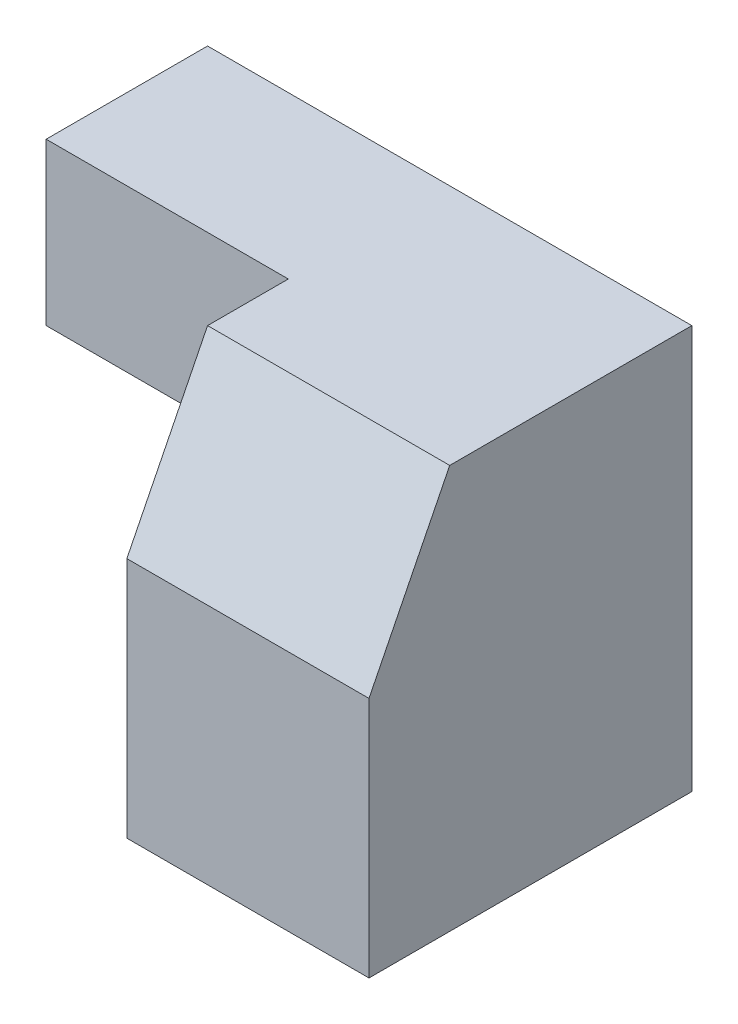
ISO-10303-21;
HEADER;
FILE_DESCRIPTION(('STEP AP214'),'2;1');
FILE_NAME('part.step','',(''),(''),'','','');
FILE_SCHEMA(('AUTOMOTIVE_DESIGN { 1 0 10303 214 1 1 1 1 }'));
ENDSEC;
DATA;
#1=APPLICATION_CONTEXT('core data for automotive mechanical design processes');
#2=APPLICATION_PROTOCOL_DEFINITION('international standard','automotive_design',2000,#1);
#3=PRODUCT_CONTEXT('',#1,'mechanical');
#4=PRODUCT('Part','Part','',(#3));
#5=PRODUCT_RELATED_PRODUCT_CATEGORY('part','',(#4));
#6=PRODUCT_DEFINITION_FORMATION('','',#4);
#7=PRODUCT_DEFINITION_CONTEXT('part definition',#1,'design');
#8=PRODUCT_DEFINITION('design','',#6,#7);
#9=PRODUCT_DEFINITION_SHAPE('','',#8);
#10=(LENGTH_UNIT() NAMED_UNIT(*) SI_UNIT(.MILLI.,.METRE.));
#11=(NAMED_UNIT(*) PLANE_ANGLE_UNIT() SI_UNIT($,.RADIAN.));
#12=(NAMED_UNIT(*) SI_UNIT($,.STERADIAN.) SOLID_ANGLE_UNIT());
#13=UNCERTAINTY_MEASURE_WITH_UNIT(LENGTH_MEASURE(1.E-05),#10,'distance_accuracy_value','');
#14=(GEOMETRIC_REPRESENTATION_CONTEXT(3) GLOBAL_UNCERTAINTY_ASSIGNED_CONTEXT((#13)) GLOBAL_UNIT_ASSIGNED_CONTEXT((#10,
#11,#12)) REPRESENTATION_CONTEXT('',''));
#15=CARTESIAN_POINT('',(0.,0.,0.));
#16=DIRECTION('',(0.,0.,1.));
#17=DIRECTION('',(1.,0.,0.));
#18=AXIS2_PLACEMENT_3D('',#15,#16,#17);
#19=CARTESIAN_POINT('',(0.,0.,20.));
#20=DIRECTION('',(1.,0.,0.));
#21=DIRECTION('',(0.,0.,-1.));
#22=AXIS2_PLACEMENT_3D('',#19,#20,#21);
#23=PLANE('',#22);
#24=DIRECTION('',(0.,-1.,0.));
#25=VECTOR('',#24,1.);
#26=CARTESIAN_POINT('',(0.,0.,0.));
#27=LINE('',#26,#25);
#28=CARTESIAN_POINT('',(0.,25.,0.));
#29=VERTEX_POINT('',#28);
#30=CARTESIAN_POINT('',(0.,15.,0.));
#31=VERTEX_POINT('',#30);
#32=EDGE_CURVE('E120',#29,#31,#27,.T.);
#33=ORIENTED_EDGE('',*,*,#32,.T.);
#34=DIRECTION('',(0.,0.,-1.));
#35=VECTOR('',#34,1.);
#36=CARTESIAN_POINT('',(0.,15.,0.));
#37=LINE('',#36,#35);
#38=CARTESIAN_POINT('',(0.,15.,10.));
#39=VERTEX_POINT('',#38);
#40=EDGE_CURVE('E113',#39,#31,#37,.T.);
#41=ORIENTED_EDGE('',*,*,#40,.F.);
#42=DIRECTION('',(0.,-1.,0.));
#43=VECTOR('',#42,1.);
#44=CARTESIAN_POINT('',(0.,0.,10.));
#45=LINE('',#44,#43);
#46=CARTESIAN_POINT('',(0.,25.,10.));
#47=VERTEX_POINT('',#46);
#48=EDGE_CURVE('E147',#47,#39,#45,.T.);
#49=ORIENTED_EDGE('',*,*,#48,.F.);
#50=DIRECTION('',(0.,0.,-1.));
#51=VECTOR('',#50,1.);
#52=CARTESIAN_POINT('',(0.,25.,20.));
#53=LINE('',#52,#51);
#54=EDGE_CURVE('E130',#47,#29,#53,.T.);
#55=ORIENTED_EDGE('',*,*,#54,.T.);
#56=EDGE_LOOP('',(#33,#41,#49,#55));
#57=FACE_BOUND('',#56,.T.);
#58=ADVANCED_FACE('F33',(#57),#23,.F.);
#59=CARTESIAN_POINT('',(0.,0.,20.));
#60=DIRECTION('',(0.,1.,0.));
#61=DIRECTION('',(0.,0.,1.));
#62=AXIS2_PLACEMENT_3D('',#59,#60,#61);
#63=PLANE('',#62);
#64=DIRECTION('',(0.,0.,1.));
#65=VECTOR('',#64,1.);
#66=CARTESIAN_POINT('',(15.,0.,10.));
#67=LINE('',#66,#65);
#68=CARTESIAN_POINT('',(15.,0.,0.));
#69=VERTEX_POINT('',#68);
#70=CARTESIAN_POINT('',(15.,0.,20.));
#71=VERTEX_POINT('',#70);
#72=EDGE_CURVE('E55',#69,#71,#67,.T.);
#73=ORIENTED_EDGE('',*,*,#72,.F.);
#74=DIRECTION('',(1.,0.,0.));
#75=VECTOR('',#74,1.);
#76=CARTESIAN_POINT('',(0.,0.,0.));
#77=LINE('',#76,#75);
#78=CARTESIAN_POINT('',(30.,0.,0.));
#79=VERTEX_POINT('',#78);
#80=EDGE_CURVE('E100',#69,#79,#77,.T.);
#81=ORIENTED_EDGE('',*,*,#80,.T.);
#82=DIRECTION('',(0.,0.,-1.));
#83=VECTOR('',#82,1.);
#84=CARTESIAN_POINT('',(30.,0.,20.));
#85=LINE('',#84,#83);
#86=CARTESIAN_POINT('',(30.,0.,20.));
#87=VERTEX_POINT('',#86);
#88=EDGE_CURVE('E11',#87,#79,#85,.T.);
#89=ORIENTED_EDGE('',*,*,#88,.F.);
#90=DIRECTION('',(1.,0.,0.));
#91=VECTOR('',#90,1.);
#92=CARTESIAN_POINT('',(0.,0.,20.));
#93=LINE('',#92,#91);
#94=EDGE_CURVE('E101',#71,#87,#93,.T.);
#95=ORIENTED_EDGE('',*,*,#94,.F.);
#96=EDGE_LOOP('',(#73,#81,#89,#95));
#97=FACE_BOUND('',#96,.T.);
#98=ADVANCED_FACE('F97',(#97),#63,.F.);
#99=CARTESIAN_POINT('',(30.,0.,20.));
#100=DIRECTION('',(-1.,0.,0.));
#101=DIRECTION('',(0.,0.,1.));
#102=AXIS2_PLACEMENT_3D('',#99,#100,#101);
#103=PLANE('',#102);
#104=DIRECTION('',(0.,0.,-1.));
#105=VECTOR('',#104,1.);
#106=CARTESIAN_POINT('',(30.,25.,20.));
#107=LINE('',#106,#105);
#108=CARTESIAN_POINT('',(30.,25.,15.));
#109=VERTEX_POINT('',#108);
#110=CARTESIAN_POINT('',(30.,25.,0.));
#111=VERTEX_POINT('',#110);
#112=EDGE_CURVE('E40',#109,#111,#107,.T.);
#113=ORIENTED_EDGE('',*,*,#112,.F.);
#114=DIRECTION('',(0.,-0.894427190999916,0.447213595499958));
#115=VECTOR('',#114,1.);
#116=CARTESIAN_POINT('',(30.,3.,26.));
#117=LINE('',#116,#115);
#118=CARTESIAN_POINT('',(30.,15.,20.));
#119=VERTEX_POINT('',#118);
#120=EDGE_CURVE('E158',#109,#119,#117,.T.);
#121=ORIENTED_EDGE('',*,*,#120,.T.);
#122=DIRECTION('',(0.,1.,0.));
#123=VECTOR('',#122,1.);
#124=CARTESIAN_POINT('',(30.,0.,20.));
#125=LINE('',#124,#123);
#126=EDGE_CURVE('E131',#87,#119,#125,.T.);
#127=ORIENTED_EDGE('',*,*,#126,.F.);
#128=ORIENTED_EDGE('',*,*,#88,.T.);
#129=DIRECTION('',(0.,1.,0.));
#130=VECTOR('',#129,1.);
#131=CARTESIAN_POINT('',(30.,0.,0.));
#132=LINE('',#131,#130);
#133=EDGE_CURVE('E119',#79,#111,#132,.T.);
#134=ORIENTED_EDGE('',*,*,#133,.T.);
#135=EDGE_LOOP('',(#113,#121,#127,#128,#134));
#136=FACE_BOUND('',#135,.T.);
#137=ADVANCED_FACE('F140',(#136),#103,.F.);
#138=CARTESIAN_POINT('',(0.,25.,20.));
#139=DIRECTION('',(0.,-1.,0.));
#140=DIRECTION('',(0.,0.,-1.));
#141=AXIS2_PLACEMENT_3D('',#138,#139,#140);
#142=PLANE('',#141);
#143=DIRECTION('',(0.,0.,1.));
#144=VECTOR('',#143,1.);
#145=CARTESIAN_POINT('',(15.,25.,10.));
#146=LINE('',#145,#144);
#147=CARTESIAN_POINT('',(15.,25.,10.));
#148=VERTEX_POINT('',#147);
#149=CARTESIAN_POINT('',(15.,25.,15.));
#150=VERTEX_POINT('',#149);
#151=EDGE_CURVE('E102',#148,#150,#146,.T.);
#152=ORIENTED_EDGE('',*,*,#151,.T.);
#153=DIRECTION('',(-1.,0.,0.));
#154=VECTOR('',#153,1.);
#155=CARTESIAN_POINT('',(35.,25.,15.));
#156=LINE('',#155,#154);
#157=EDGE_CURVE('E47',#109,#150,#156,.T.);
#158=ORIENTED_EDGE('',*,*,#157,.F.);
#159=ORIENTED_EDGE('',*,*,#112,.T.);
#160=DIRECTION('',(-1.,0.,0.));
#161=VECTOR('',#160,1.);
#162=CARTESIAN_POINT('',(0.,25.,0.));
#163=LINE('',#162,#161);
#164=EDGE_CURVE('E122',#111,#29,#163,.T.);
#165=ORIENTED_EDGE('',*,*,#164,.T.);
#166=ORIENTED_EDGE('',*,*,#54,.F.);
#167=DIRECTION('',(-1.,0.,0.));
#168=VECTOR('',#167,1.);
#169=CARTESIAN_POINT('',(0.,25.,10.));
#170=LINE('',#169,#168);
#171=EDGE_CURVE('E103',#148,#47,#170,.T.);
#172=ORIENTED_EDGE('',*,*,#171,.F.);
#173=EDGE_LOOP('',(#152,#158,#159,#165,#166,#172));
#174=FACE_BOUND('',#173,.T.);
#175=ADVANCED_FACE('F135',(#174),#142,.F.);
#176=CARTESIAN_POINT('',(0.,0.,20.));
#177=DIRECTION('',(0.,0.,-1.));
#178=DIRECTION('',(-1.,0.,0.));
#179=AXIS2_PLACEMENT_3D('',#176,#177,#178);
#180=PLANE('',#179);
#181=ORIENTED_EDGE('',*,*,#126,.T.);
#182=DIRECTION('',(-1.,0.,0.));
#183=VECTOR('',#182,1.);
#184=CARTESIAN_POINT('',(35.,15.,20.));
#185=LINE('',#184,#183);
#186=CARTESIAN_POINT('',(15.,15.,20.));
#187=VERTEX_POINT('',#186);
#188=EDGE_CURVE('E164',#119,#187,#185,.T.);
#189=ORIENTED_EDGE('',*,*,#188,.T.);
#190=DIRECTION('',(0.,1.,0.));
#191=VECTOR('',#190,1.);
#192=CARTESIAN_POINT('',(15.,0.,20.));
#193=LINE('',#192,#191);
#194=EDGE_CURVE('E156',#71,#187,#193,.T.);
#195=ORIENTED_EDGE('',*,*,#194,.F.);
#196=ORIENTED_EDGE('',*,*,#94,.T.);
#197=EDGE_LOOP('',(#181,#189,#195,#196));
#198=FACE_BOUND('',#197,.T.);
#199=ADVANCED_FACE('F163',(#198),#180,.F.);
#200=CARTESIAN_POINT('',(0.,0.,0.));
#201=DIRECTION('',(0.,0.,-1.));
#202=DIRECTION('',(-1.,0.,0.));
#203=AXIS2_PLACEMENT_3D('',#200,#201,#202);
#204=PLANE('',#203);
#205=DIRECTION('',(-1.,0.,0.));
#206=VECTOR('',#205,1.);
#207=CARTESIAN_POINT('',(15.,15.,0.));
#208=LINE('',#207,#206);
#209=CARTESIAN_POINT('',(15.,15.,0.));
#210=VERTEX_POINT('',#209);
#211=EDGE_CURVE('E142',#210,#31,#208,.T.);
#212=ORIENTED_EDGE('',*,*,#211,.T.);
#213=ORIENTED_EDGE('',*,*,#32,.F.);
#214=ORIENTED_EDGE('',*,*,#164,.F.);
#215=ORIENTED_EDGE('',*,*,#133,.F.);
#216=ORIENTED_EDGE('',*,*,#80,.F.);
#217=DIRECTION('',(0.,-1.,0.));
#218=VECTOR('',#217,1.);
#219=CARTESIAN_POINT('',(15.,0.,0.));
#220=LINE('',#219,#218);
#221=EDGE_CURVE('E107',#210,#69,#220,.T.);
#222=ORIENTED_EDGE('',*,*,#221,.F.);
#223=EDGE_LOOP('',(#212,#213,#214,#215,#216,#222));
#224=FACE_BOUND('',#223,.T.);
#225=ADVANCED_FACE('F116',(#224),#204,.T.);
#226=CARTESIAN_POINT('',(15.,0.,10.));
#227=DIRECTION('',(1.,0.,0.));
#228=DIRECTION('',(0.,0.,-1.));
#229=AXIS2_PLACEMENT_3D('',#226,#227,#228);
#230=PLANE('',#229);
#231=ORIENTED_EDGE('',*,*,#194,.T.);
#232=DIRECTION('',(0.,-0.894427190999916,0.447213595499958));
#233=VECTOR('',#232,1.);
#234=CARTESIAN_POINT('',(15.,25.,15.));
#235=LINE('',#234,#233);
#236=EDGE_CURVE('E173',#150,#187,#235,.T.);
#237=ORIENTED_EDGE('',*,*,#236,.F.);
#238=ORIENTED_EDGE('',*,*,#151,.F.);
#239=DIRECTION('',(0.,1.,0.));
#240=VECTOR('',#239,1.);
#241=CARTESIAN_POINT('',(15.,0.,10.));
#242=LINE('',#241,#240);
#243=CARTESIAN_POINT('',(15.,15.,10.));
#244=VERTEX_POINT('',#243);
#245=EDGE_CURVE('E151',#244,#148,#242,.T.);
#246=ORIENTED_EDGE('',*,*,#245,.F.);
#247=DIRECTION('',(0.,0.,-1.));
#248=VECTOR('',#247,1.);
#249=CARTESIAN_POINT('',(15.,15.,0.));
#250=LINE('',#249,#248);
#251=EDGE_CURVE('E110',#244,#210,#250,.T.);
#252=ORIENTED_EDGE('',*,*,#251,.T.);
#253=ORIENTED_EDGE('',*,*,#221,.T.);
#254=ORIENTED_EDGE('',*,*,#72,.T.);
#255=EDGE_LOOP('',(#231,#237,#238,#246,#252,#253,#254));
#256=FACE_BOUND('',#255,.T.);
#257=ADVANCED_FACE('F108',(#256),#230,.F.);
#258=CARTESIAN_POINT('',(0.,0.,10.));
#259=DIRECTION('',(0.,0.,-1.));
#260=DIRECTION('',(-1.,0.,0.));
#261=AXIS2_PLACEMENT_3D('',#258,#259,#260);
#262=PLANE('',#261);
#263=ORIENTED_EDGE('',*,*,#48,.T.);
#264=DIRECTION('',(-1.,0.,0.));
#265=VECTOR('',#264,1.);
#266=CARTESIAN_POINT('',(15.,15.,10.));
#267=LINE('',#266,#265);
#268=EDGE_CURVE('E170',#244,#39,#267,.T.);
#269=ORIENTED_EDGE('',*,*,#268,.F.);
#270=ORIENTED_EDGE('',*,*,#245,.T.);
#271=ORIENTED_EDGE('',*,*,#171,.T.);
#272=EDGE_LOOP('',(#263,#269,#270,#271));
#273=FACE_BOUND('',#272,.T.);
#274=ADVANCED_FACE('F169',(#273),#262,.F.);
#275=CARTESIAN_POINT('',(35.,25.,15.));
#276=DIRECTION('',(0.,-0.447213595499958,-0.894427190999916));
#277=DIRECTION('',(0.,0.894427190999916,-0.447213595499958));
#278=AXIS2_PLACEMENT_3D('',#275,#276,#277);
#279=PLANE('',#278);
#280=ORIENTED_EDGE('',*,*,#157,.T.);
#281=ORIENTED_EDGE('',*,*,#236,.T.);
#282=ORIENTED_EDGE('',*,*,#188,.F.);
#283=ORIENTED_EDGE('',*,*,#120,.F.);
#284=EDGE_LOOP('',(#280,#281,#282,#283));
#285=FACE_BOUND('',#284,.T.);
#286=ADVANCED_FACE('F180',(#285),#279,.F.);
#287=CARTESIAN_POINT('',(15.,15.,0.));
#288=DIRECTION('',(0.,1.,0.));
#289=DIRECTION('',(0.,0.,1.));
#290=AXIS2_PLACEMENT_3D('',#287,#288,#289);
#291=PLANE('',#290);
#292=ORIENTED_EDGE('',*,*,#40,.T.);
#293=ORIENTED_EDGE('',*,*,#211,.F.);
#294=ORIENTED_EDGE('',*,*,#251,.F.);
#295=ORIENTED_EDGE('',*,*,#268,.T.);
#296=EDGE_LOOP('',(#292,#293,#294,#295));
#297=FACE_BOUND('',#296,.T.);
#298=ADVANCED_FACE('F178',(#297),#291,.F.);
#299=CLOSED_SHELL('',(#58,#98,#137,#175,#199,#225,#257,#274,#286,#298));
#300=MANIFOLD_SOLID_BREP('B2',#299);
#301=ADVANCED_BREP_SHAPE_REPRESENTATION('',(#18,#300),#14);
#302=SHAPE_DEFINITION_REPRESENTATION(#9,#301);
ENDSEC;
END-ISO-10303-21;
